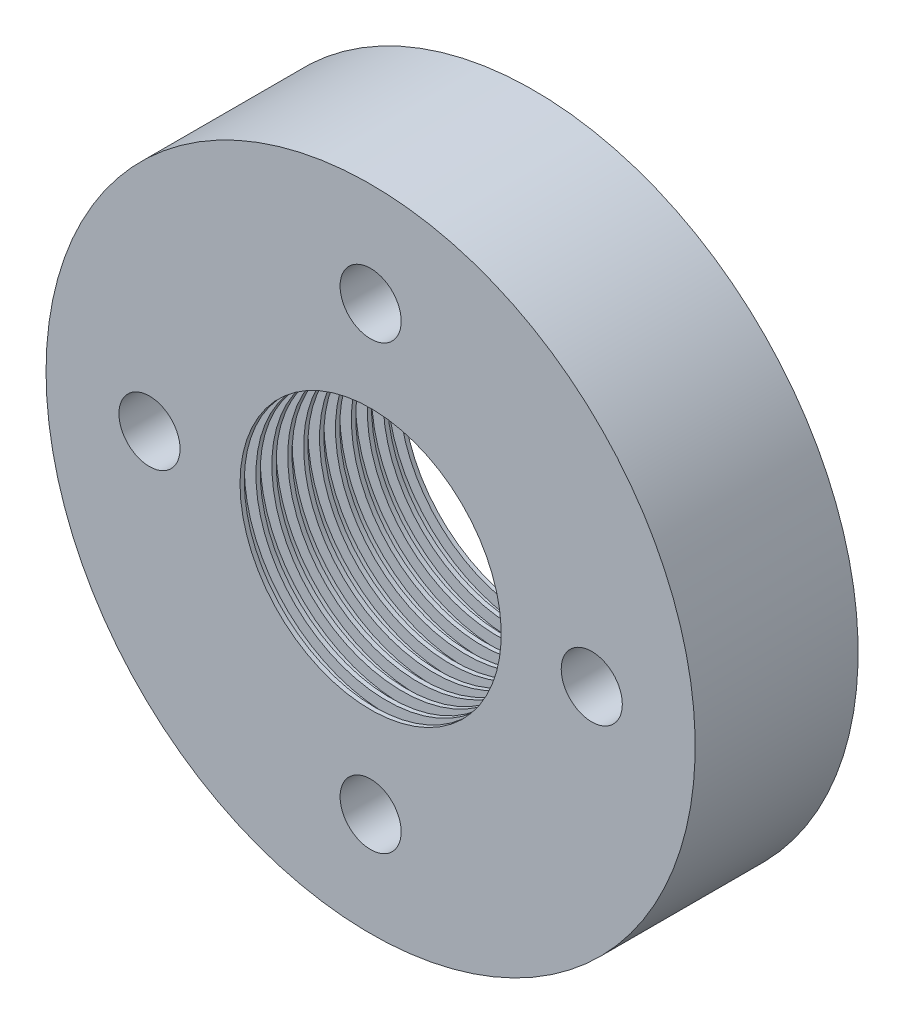
ISO-10303-21;
HEADER;
FILE_DESCRIPTION(('STEP AP214'),'2;1');
FILE_NAME('part.step','',(''),(''),'','','');
FILE_SCHEMA(('AUTOMOTIVE_DESIGN { 1 0 10303 214 1 1 1 1 }'));
ENDSEC;
DATA;
#1=APPLICATION_CONTEXT('core data for automotive mechanical design processes');
#2=APPLICATION_PROTOCOL_DEFINITION('international standard','automotive_design',2000,#1);
#3=PRODUCT_CONTEXT('',#1,'mechanical');
#4=PRODUCT('Part','Part','',(#3));
#5=PRODUCT_RELATED_PRODUCT_CATEGORY('part','',(#4));
#6=PRODUCT_DEFINITION_FORMATION('','',#4);
#7=PRODUCT_DEFINITION_CONTEXT('part definition',#1,'design');
#8=PRODUCT_DEFINITION('design','',#6,#7);
#9=PRODUCT_DEFINITION_SHAPE('','',#8);
#10=(LENGTH_UNIT() NAMED_UNIT(*) SI_UNIT(.MILLI.,.METRE.));
#11=(NAMED_UNIT(*) PLANE_ANGLE_UNIT() SI_UNIT($,.RADIAN.));
#12=(NAMED_UNIT(*) SI_UNIT($,.STERADIAN.) SOLID_ANGLE_UNIT());
#13=UNCERTAINTY_MEASURE_WITH_UNIT(LENGTH_MEASURE(1.E-05),#10,'distance_accuracy_value','');
#14=(GEOMETRIC_REPRESENTATION_CONTEXT(3) GLOBAL_UNCERTAINTY_ASSIGNED_CONTEXT((#13)) GLOBAL_UNIT_ASSIGNED_CONTEXT((#10,
#11,#12)) REPRESENTATION_CONTEXT('',''));
#15=CARTESIAN_POINT('',(0.,0.,0.));
#16=DIRECTION('',(0.,0.,1.));
#17=DIRECTION('',(1.,0.,0.));
#18=AXIS2_PLACEMENT_3D('',#15,#16,#17);
#19=CARTESIAN_POINT('',(0.,0.,0.));
#20=DIRECTION('',(0.,0.,-1.));
#21=DIRECTION('',(-1.,0.,0.));
#22=AXIS2_PLACEMENT_3D('',#19,#20,#21);
#23=CYLINDRICAL_SURFACE('',#22,8.5508);
#24=CARTESIAN_POINT('',(0.,0.,9.3472));
#25=DIRECTION('',(0.,0.,1.));
#26=DIRECTION('',(1.,0.,0.));
#27=AXIS2_PLACEMENT_3D('',#24,#25,#26);
#28=CIRCLE('',#27,8.5508);
#29=CARTESIAN_POINT('',(8.5508,0.,9.3472));
#30=VERTEX_POINT('',#29);
#31=EDGE_CURVE('E159',#30,#30,#28,.T.);
#32=ORIENTED_EDGE('',*,*,#31,.F.);
#33=EDGE_LOOP('',(#32));
#34=FACE_BOUND('',#33,.T.);
#35=CARTESIAN_POINT('',(0.,0.,9.6266));
#36=DIRECTION('',(0.,0.,1.));
#37=DIRECTION('',(1.,0.,0.));
#38=AXIS2_PLACEMENT_3D('',#35,#36,#37);
#39=CIRCLE('',#38,8.5508);
#40=CARTESIAN_POINT('',(8.5508,0.,9.6266));
#41=VERTEX_POINT('',#40);
#42=EDGE_CURVE('E168',#41,#41,#39,.T.);
#43=ORIENTED_EDGE('',*,*,#42,.T.);
#44=EDGE_LOOP('',(#43));
#45=FACE_BOUND('',#44,.T.);
#46=ADVANCED_FACE('F37',(#34,#45),#23,.F.);
#47=CARTESIAN_POINT('',(0.,0.,10.668));
#48=DIRECTION('',(0.,0.,-1.));
#49=DIRECTION('',(-1.,0.,0.));
#50=AXIS2_PLACEMENT_3D('',#47,#48,#49);
#51=CIRCLE('',#50,8.5508);
#52=CARTESIAN_POINT('',(-8.5508,0.,10.668));
#53=VERTEX_POINT('',#52);
#54=EDGE_CURVE('E10',#53,#53,#51,.T.);
#55=ORIENTED_EDGE('',*,*,#54,.F.);
#56=EDGE_LOOP('',(#55));
#57=FACE_BOUND('',#56,.T.);
#58=CARTESIAN_POINT('',(0.,0.,10.3886));
#59=DIRECTION('',(0.,0.,1.));
#60=DIRECTION('',(1.,0.,0.));
#61=AXIS2_PLACEMENT_3D('',#58,#59,#60);
#62=CIRCLE('',#61,8.5508);
#63=CARTESIAN_POINT('',(8.5508,0.,10.3886));
#64=VERTEX_POINT('',#63);
#65=EDGE_CURVE('E171',#64,#64,#62,.T.);
#66=ORIENTED_EDGE('',*,*,#65,.F.);
#67=EDGE_LOOP('',(#66));
#68=FACE_BOUND('',#67,.T.);
#69=ADVANCED_FACE('F253',(#57,#68),#23,.F.);
#70=CARTESIAN_POINT('',(0.,0.,8.3058));
#71=DIRECTION('',(0.,0.,1.));
#72=DIRECTION('',(1.,0.,0.));
#73=AXIS2_PLACEMENT_3D('',#70,#71,#72);
#74=CIRCLE('',#73,8.5508);
#75=CARTESIAN_POINT('',(8.5508,0.,8.3058));
#76=VERTEX_POINT('',#75);
#77=EDGE_CURVE('E147',#76,#76,#74,.T.);
#78=ORIENTED_EDGE('',*,*,#77,.F.);
#79=EDGE_LOOP('',(#78));
#80=FACE_BOUND('',#79,.T.);
#81=CARTESIAN_POINT('',(0.,0.,8.5852));
#82=DIRECTION('',(0.,0.,1.));
#83=DIRECTION('',(1.,0.,0.));
#84=AXIS2_PLACEMENT_3D('',#81,#82,#83);
#85=CIRCLE('',#84,8.5508);
#86=CARTESIAN_POINT('',(8.5508,0.,8.5852));
#87=VERTEX_POINT('',#86);
#88=EDGE_CURVE('E156',#87,#87,#85,.T.);
#89=ORIENTED_EDGE('',*,*,#88,.T.);
#90=EDGE_LOOP('',(#89));
#91=FACE_BOUND('',#90,.T.);
#92=ADVANCED_FACE('F258',(#80,#91),#23,.F.);
#93=CARTESIAN_POINT('',(0.,0.,7.2644));
#94=DIRECTION('',(0.,0.,1.));
#95=DIRECTION('',(1.,0.,0.));
#96=AXIS2_PLACEMENT_3D('',#93,#94,#95);
#97=CIRCLE('',#96,8.5508);
#98=CARTESIAN_POINT('',(8.5508,0.,7.2644));
#99=VERTEX_POINT('',#98);
#100=EDGE_CURVE('E135',#99,#99,#97,.T.);
#101=ORIENTED_EDGE('',*,*,#100,.F.);
#102=EDGE_LOOP('',(#101));
#103=FACE_BOUND('',#102,.T.);
#104=CARTESIAN_POINT('',(0.,0.,7.5438));
#105=DIRECTION('',(0.,0.,1.));
#106=DIRECTION('',(1.,0.,0.));
#107=AXIS2_PLACEMENT_3D('',#104,#105,#106);
#108=CIRCLE('',#107,8.5508);
#109=CARTESIAN_POINT('',(8.5508,0.,7.5438));
#110=VERTEX_POINT('',#109);
#111=EDGE_CURVE('E144',#110,#110,#108,.T.);
#112=ORIENTED_EDGE('',*,*,#111,.T.);
#113=EDGE_LOOP('',(#112));
#114=FACE_BOUND('',#113,.T.);
#115=ADVANCED_FACE('F435',(#103,#114),#23,.F.);
#116=CARTESIAN_POINT('',(0.,0.,6.223));
#117=DIRECTION('',(0.,0.,1.));
#118=DIRECTION('',(1.,0.,0.));
#119=AXIS2_PLACEMENT_3D('',#116,#117,#118);
#120=CIRCLE('',#119,8.5508);
#121=CARTESIAN_POINT('',(8.5508,0.,6.223));
#122=VERTEX_POINT('',#121);
#123=EDGE_CURVE('E123',#122,#122,#120,.T.);
#124=ORIENTED_EDGE('',*,*,#123,.F.);
#125=EDGE_LOOP('',(#124));
#126=FACE_BOUND('',#125,.T.);
#127=CARTESIAN_POINT('',(0.,0.,6.5024));
#128=DIRECTION('',(0.,0.,1.));
#129=DIRECTION('',(1.,0.,0.));
#130=AXIS2_PLACEMENT_3D('',#127,#128,#129);
#131=CIRCLE('',#130,8.5508);
#132=CARTESIAN_POINT('',(8.5508,0.,6.5024));
#133=VERTEX_POINT('',#132);
#134=EDGE_CURVE('E132',#133,#133,#131,.T.);
#135=ORIENTED_EDGE('',*,*,#134,.T.);
#136=EDGE_LOOP('',(#135));
#137=FACE_BOUND('',#136,.T.);
#138=ADVANCED_FACE('F422',(#126,#137),#23,.F.);
#139=CARTESIAN_POINT('',(0.,0.,5.1816));
#140=DIRECTION('',(0.,0.,1.));
#141=DIRECTION('',(1.,0.,0.));
#142=AXIS2_PLACEMENT_3D('',#139,#140,#141);
#143=CIRCLE('',#142,8.5508);
#144=CARTESIAN_POINT('',(8.5508,0.,5.1816));
#145=VERTEX_POINT('',#144);
#146=EDGE_CURVE('E111',#145,#145,#143,.T.);
#147=ORIENTED_EDGE('',*,*,#146,.F.);
#148=EDGE_LOOP('',(#147));
#149=FACE_BOUND('',#148,.T.);
#150=CARTESIAN_POINT('',(0.,0.,5.461));
#151=DIRECTION('',(0.,0.,1.));
#152=DIRECTION('',(1.,0.,0.));
#153=AXIS2_PLACEMENT_3D('',#150,#151,#152);
#154=CIRCLE('',#153,8.5508);
#155=CARTESIAN_POINT('',(8.5508,0.,5.461));
#156=VERTEX_POINT('',#155);
#157=EDGE_CURVE('E120',#156,#156,#154,.T.);
#158=ORIENTED_EDGE('',*,*,#157,.T.);
#159=EDGE_LOOP('',(#158));
#160=FACE_BOUND('',#159,.T.);
#161=ADVANCED_FACE('F409',(#149,#160),#23,.F.);
#162=CARTESIAN_POINT('',(0.,0.,4.1402));
#163=DIRECTION('',(0.,0.,1.));
#164=DIRECTION('',(1.,0.,0.));
#165=AXIS2_PLACEMENT_3D('',#162,#163,#164);
#166=CIRCLE('',#165,8.5508);
#167=CARTESIAN_POINT('',(8.5508,0.,4.1402));
#168=VERTEX_POINT('',#167);
#169=EDGE_CURVE('E99',#168,#168,#166,.T.);
#170=ORIENTED_EDGE('',*,*,#169,.F.);
#171=EDGE_LOOP('',(#170));
#172=FACE_BOUND('',#171,.T.);
#173=CARTESIAN_POINT('',(0.,0.,4.4196));
#174=DIRECTION('',(0.,0.,1.));
#175=DIRECTION('',(1.,0.,0.));
#176=AXIS2_PLACEMENT_3D('',#173,#174,#175);
#177=CIRCLE('',#176,8.5508);
#178=CARTESIAN_POINT('',(8.5508,0.,4.4196));
#179=VERTEX_POINT('',#178);
#180=EDGE_CURVE('E108',#179,#179,#177,.T.);
#181=ORIENTED_EDGE('',*,*,#180,.T.);
#182=EDGE_LOOP('',(#181));
#183=FACE_BOUND('',#182,.T.);
#184=ADVANCED_FACE('F399',(#172,#183),#23,.F.);
#185=CARTESIAN_POINT('',(0.,0.,3.0988));
#186=DIRECTION('',(0.,0.,1.));
#187=DIRECTION('',(1.,0.,0.));
#188=AXIS2_PLACEMENT_3D('',#185,#186,#187);
#189=CIRCLE('',#188,8.5508);
#190=CARTESIAN_POINT('',(8.5508,0.,3.0988));
#191=VERTEX_POINT('',#190);
#192=EDGE_CURVE('E87',#191,#191,#189,.T.);
#193=ORIENTED_EDGE('',*,*,#192,.F.);
#194=EDGE_LOOP('',(#193));
#195=FACE_BOUND('',#194,.T.);
#196=CARTESIAN_POINT('',(0.,0.,3.3782));
#197=DIRECTION('',(0.,0.,1.));
#198=DIRECTION('',(1.,0.,0.));
#199=AXIS2_PLACEMENT_3D('',#196,#197,#198);
#200=CIRCLE('',#199,8.5508);
#201=CARTESIAN_POINT('',(8.5508,0.,3.3782));
#202=VERTEX_POINT('',#201);
#203=EDGE_CURVE('E96',#202,#202,#200,.T.);
#204=ORIENTED_EDGE('',*,*,#203,.T.);
#205=EDGE_LOOP('',(#204));
#206=FACE_BOUND('',#205,.T.);
#207=ADVANCED_FACE('F389',(#195,#206),#23,.F.);
#208=CARTESIAN_POINT('',(0.,0.,2.0574));
#209=DIRECTION('',(0.,0.,1.));
#210=DIRECTION('',(1.,0.,0.));
#211=AXIS2_PLACEMENT_3D('',#208,#209,#210);
#212=CIRCLE('',#211,8.5508);
#213=CARTESIAN_POINT('',(8.5508,0.,2.0574));
#214=VERTEX_POINT('',#213);
#215=EDGE_CURVE('E75',#214,#214,#212,.T.);
#216=ORIENTED_EDGE('',*,*,#215,.F.);
#217=EDGE_LOOP('',(#216));
#218=FACE_BOUND('',#217,.T.);
#219=CARTESIAN_POINT('',(0.,0.,2.3368));
#220=DIRECTION('',(0.,0.,1.));
#221=DIRECTION('',(1.,0.,0.));
#222=AXIS2_PLACEMENT_3D('',#219,#220,#221);
#223=CIRCLE('',#222,8.5508);
#224=CARTESIAN_POINT('',(8.5508,0.,2.3368));
#225=VERTEX_POINT('',#224);
#226=EDGE_CURVE('E84',#225,#225,#223,.T.);
#227=ORIENTED_EDGE('',*,*,#226,.T.);
#228=EDGE_LOOP('',(#227));
#229=FACE_BOUND('',#228,.T.);
#230=ADVANCED_FACE('F384',(#218,#229),#23,.F.);
#231=CARTESIAN_POINT('',(0.,0.,1.016));
#232=DIRECTION('',(0.,0.,1.));
#233=DIRECTION('',(1.,0.,0.));
#234=AXIS2_PLACEMENT_3D('',#231,#232,#233);
#235=CIRCLE('',#234,8.5508);
#236=CARTESIAN_POINT('',(8.5508,0.,1.016));
#237=VERTEX_POINT('',#236);
#238=EDGE_CURVE('E63',#237,#237,#235,.T.);
#239=ORIENTED_EDGE('',*,*,#238,.F.);
#240=EDGE_LOOP('',(#239));
#241=FACE_BOUND('',#240,.T.);
#242=CARTESIAN_POINT('',(0.,0.,1.2954));
#243=DIRECTION('',(0.,0.,1.));
#244=DIRECTION('',(1.,0.,0.));
#245=AXIS2_PLACEMENT_3D('',#242,#243,#244);
#246=CIRCLE('',#245,8.5508);
#247=CARTESIAN_POINT('',(8.5508,0.,1.2954));
#248=VERTEX_POINT('',#247);
#249=EDGE_CURVE('E72',#248,#248,#246,.T.);
#250=ORIENTED_EDGE('',*,*,#249,.T.);
#251=EDGE_LOOP('',(#250));
#252=FACE_BOUND('',#251,.T.);
#253=ADVANCED_FACE('F235',(#241,#252),#23,.F.);
#254=CARTESIAN_POINT('',(0.,0.,0.));
#255=DIRECTION('',(0.,0.,-1.));
#256=DIRECTION('',(-1.,0.,0.));
#257=AXIS2_PLACEMENT_3D('',#254,#255,#256);
#258=CIRCLE('',#257,8.5508);
#259=CARTESIAN_POINT('',(-8.5508,0.,0.));
#260=VERTEX_POINT('',#259);
#261=EDGE_CURVE('E52',#260,#260,#258,.T.);
#262=ORIENTED_EDGE('',*,*,#261,.T.);
#263=EDGE_LOOP('',(#262));
#264=FACE_BOUND('',#263,.T.);
#265=CARTESIAN_POINT('',(0.,0.,0.254000000000001));
#266=DIRECTION('',(0.,0.,1.));
#267=DIRECTION('',(1.,0.,0.));
#268=AXIS2_PLACEMENT_3D('',#265,#266,#267);
#269=CIRCLE('',#268,8.5508);
#270=CARTESIAN_POINT('',(8.5508,0.,0.254000000000001));
#271=VERTEX_POINT('',#270);
#272=EDGE_CURVE('E60',#271,#271,#269,.T.);
#273=ORIENTED_EDGE('',*,*,#272,.T.);
#274=EDGE_LOOP('',(#273));
#275=FACE_BOUND('',#274,.T.);
#276=ADVANCED_FACE('F39',(#264,#275),#23,.F.);
#277=CARTESIAN_POINT('',(0.,8.5508,10.668));
#278=DIRECTION('',(0.,0.,1.));
#279=DIRECTION('',(1.,0.,0.));
#280=AXIS2_PLACEMENT_3D('',#277,#278,#279);
#281=PLANE('',#280);
#282=CARTESIAN_POINT('',(-14.478,1.51649000471313E-13,10.668));
#283=DIRECTION('',(0.,0.,1.));
#284=DIRECTION('',(1.,0.,0.));
#285=AXIS2_PLACEMENT_3D('',#282,#283,#284);
#286=CIRCLE('',#285,2.);
#287=CARTESIAN_POINT('',(-12.478,1.51649000471313E-13,10.668));
#288=VERTEX_POINT('',#287);
#289=EDGE_CURVE('E204',#288,#288,#286,.T.);
#290=ORIENTED_EDGE('',*,*,#289,.F.);
#291=EDGE_LOOP('',(#290));
#292=FACE_BOUND('',#291,.T.);
#293=CARTESIAN_POINT('',(0.,-14.478,10.668));
#294=DIRECTION('',(0.,0.,1.));
#295=DIRECTION('',(1.,0.,0.));
#296=AXIS2_PLACEMENT_3D('',#293,#294,#295);
#297=CIRCLE('',#296,2.);
#298=CARTESIAN_POINT('',(2.,-14.478,10.668));
#299=VERTEX_POINT('',#298);
#300=EDGE_CURVE('E195',#299,#299,#297,.T.);
#301=ORIENTED_EDGE('',*,*,#300,.F.);
#302=EDGE_LOOP('',(#301));
#303=FACE_BOUND('',#302,.T.);
#304=CARTESIAN_POINT('',(14.478,0.,10.668));
#305=DIRECTION('',(0.,0.,1.));
#306=DIRECTION('',(1.,0.,0.));
#307=AXIS2_PLACEMENT_3D('',#304,#305,#306);
#308=CIRCLE('',#307,2.);
#309=CARTESIAN_POINT('',(16.478,0.,10.668));
#310=VERTEX_POINT('',#309);
#311=EDGE_CURVE('E186',#310,#310,#308,.T.);
#312=ORIENTED_EDGE('',*,*,#311,.F.);
#313=EDGE_LOOP('',(#312));
#314=FACE_BOUND('',#313,.T.);
#315=CARTESIAN_POINT('',(0.,14.478,10.668));
#316=DIRECTION('',(0.,0.,1.));
#317=DIRECTION('',(1.,0.,0.));
#318=AXIS2_PLACEMENT_3D('',#315,#316,#317);
#319=CIRCLE('',#318,2.);
#320=CARTESIAN_POINT('',(2.,14.478,10.668));
#321=VERTEX_POINT('',#320);
#322=EDGE_CURVE('E177',#321,#321,#319,.T.);
#323=ORIENTED_EDGE('',*,*,#322,.F.);
#324=EDGE_LOOP('',(#323));
#325=FACE_BOUND('',#324,.T.);
#326=ORIENTED_EDGE('',*,*,#54,.T.);
#327=EDGE_LOOP('',(#326));
#328=FACE_BOUND('',#327,.T.);
#329=CARTESIAN_POINT('',(0.,0.,10.668));
#330=DIRECTION('',(0.,0.,-1.));
#331=DIRECTION('',(-1.,0.,0.));
#332=AXIS2_PLACEMENT_3D('',#329,#330,#331);
#333=CIRCLE('',#332,21.2508);
#334=CARTESIAN_POINT('',(-21.2508,0.,10.668));
#335=VERTEX_POINT('',#334);
#336=EDGE_CURVE('E44',#335,#335,#333,.T.);
#337=ORIENTED_EDGE('',*,*,#336,.F.);
#338=EDGE_LOOP('',(#337));
#339=FACE_BOUND('',#338,.T.);
#340=ADVANCED_FACE('F234',(#292,#303,#314,#325,#328,#339),#281,.T.);
#341=CARTESIAN_POINT('',(0.,0.,0.));
#342=DIRECTION('',(0.,0.,-1.));
#343=DIRECTION('',(-1.,0.,0.));
#344=AXIS2_PLACEMENT_3D('',#341,#342,#343);
#345=CYLINDRICAL_SURFACE('',#344,21.2508);
#346=ORIENTED_EDGE('',*,*,#336,.T.);
#347=EDGE_LOOP('',(#346));
#348=FACE_BOUND('',#347,.T.);
#349=CARTESIAN_POINT('',(0.,0.,0.));
#350=DIRECTION('',(0.,0.,-1.));
#351=DIRECTION('',(-1.,0.,0.));
#352=AXIS2_PLACEMENT_3D('',#349,#350,#351);
#353=CIRCLE('',#352,21.2508);
#354=CARTESIAN_POINT('',(-21.2508,0.,0.));
#355=VERTEX_POINT('',#354);
#356=EDGE_CURVE('E48',#355,#355,#353,.T.);
#357=ORIENTED_EDGE('',*,*,#356,.F.);
#358=EDGE_LOOP('',(#357));
#359=FACE_BOUND('',#358,.T.);
#360=ADVANCED_FACE('F220',(#348,#359),#345,.T.);
#361=CARTESIAN_POINT('',(0.,21.2508,0.));
#362=DIRECTION('',(0.,0.,-1.));
#363=DIRECTION('',(-1.,0.,0.));
#364=AXIS2_PLACEMENT_3D('',#361,#362,#363);
#365=PLANE('',#364);
#366=CARTESIAN_POINT('',(-14.478,1.51649000471313E-13,0.));
#367=DIRECTION('',(0.,0.,-1.));
#368=DIRECTION('',(-1.,0.,0.));
#369=AXIS2_PLACEMENT_3D('',#366,#367,#368);
#370=CIRCLE('',#369,2.025);
#371=CARTESIAN_POINT('',(-16.503,1.51649000471313E-13,0.));
#372=VERTEX_POINT('',#371);
#373=EDGE_CURVE('E210',#372,#372,#370,.T.);
#374=ORIENTED_EDGE('',*,*,#373,.F.);
#375=EDGE_LOOP('',(#374));
#376=FACE_BOUND('',#375,.T.);
#377=CARTESIAN_POINT('',(0.,-14.478,0.));
#378=DIRECTION('',(0.,0.,-1.));
#379=DIRECTION('',(-1.,0.,0.));
#380=AXIS2_PLACEMENT_3D('',#377,#378,#379);
#381=CIRCLE('',#380,2.025);
#382=CARTESIAN_POINT('',(-2.025,-14.478,0.));
#383=VERTEX_POINT('',#382);
#384=EDGE_CURVE('E201',#383,#383,#381,.T.);
#385=ORIENTED_EDGE('',*,*,#384,.F.);
#386=EDGE_LOOP('',(#385));
#387=FACE_BOUND('',#386,.T.);
#388=CARTESIAN_POINT('',(14.478,0.,0.));
#389=DIRECTION('',(0.,0.,-1.));
#390=DIRECTION('',(-1.,0.,0.));
#391=AXIS2_PLACEMENT_3D('',#388,#389,#390);
#392=CIRCLE('',#391,2.025);
#393=CARTESIAN_POINT('',(12.453,0.,0.));
#394=VERTEX_POINT('',#393);
#395=EDGE_CURVE('E192',#394,#394,#392,.T.);
#396=ORIENTED_EDGE('',*,*,#395,.F.);
#397=EDGE_LOOP('',(#396));
#398=FACE_BOUND('',#397,.T.);
#399=CARTESIAN_POINT('',(0.,14.478,0.));
#400=DIRECTION('',(0.,0.,-1.));
#401=DIRECTION('',(-1.,0.,0.));
#402=AXIS2_PLACEMENT_3D('',#399,#400,#401);
#403=CIRCLE('',#402,2.025);
#404=CARTESIAN_POINT('',(-2.025,14.478,0.));
#405=VERTEX_POINT('',#404);
#406=EDGE_CURVE('E183',#405,#405,#403,.T.);
#407=ORIENTED_EDGE('',*,*,#406,.F.);
#408=EDGE_LOOP('',(#407));
#409=FACE_BOUND('',#408,.T.);
#410=ORIENTED_EDGE('',*,*,#356,.T.);
#411=EDGE_LOOP('',(#410));
#412=FACE_BOUND('',#411,.T.);
#413=ORIENTED_EDGE('',*,*,#261,.F.);
#414=EDGE_LOOP('',(#413));
#415=FACE_BOUND('',#414,.T.);
#416=ADVANCED_FACE('F216',(#376,#387,#398,#409,#412,#415),#365,.T.);
#417=CARTESIAN_POINT('',(0.,0.,10.668));
#418=DIRECTION('',(0.,0.,1.));
#419=DIRECTION('',(1.,0.,0.));
#420=AXIS2_PLACEMENT_3D('',#417,#418,#419);
#421=CYLINDRICAL_SURFACE('',#420,9.3128);
#422=CARTESIAN_POINT('',(0.,0.,1.016));
#423=DIRECTION('',(0.,0.,1.));
#424=DIRECTION('',(1.,0.,0.));
#425=AXIS2_PLACEMENT_3D('',#422,#423,#424);
#426=CIRCLE('',#425,9.3128);
#427=CARTESIAN_POINT('',(9.3128,0.,1.016));
#428=VERTEX_POINT('',#427);
#429=EDGE_CURVE('E66',#428,#428,#426,.T.);
#430=ORIENTED_EDGE('',*,*,#429,.T.);
#431=EDGE_LOOP('',(#430));
#432=FACE_BOUND('',#431,.T.);
#433=CARTESIAN_POINT('',(0.,0.,0.254000000000001));
#434=DIRECTION('',(0.,0.,1.));
#435=DIRECTION('',(1.,0.,0.));
#436=AXIS2_PLACEMENT_3D('',#433,#434,#435);
#437=CIRCLE('',#436,9.3128);
#438=CARTESIAN_POINT('',(9.3128,0.,0.254000000000001));
#439=VERTEX_POINT('',#438);
#440=EDGE_CURVE('E57',#439,#439,#437,.T.);
#441=ORIENTED_EDGE('',*,*,#440,.F.);
#442=EDGE_LOOP('',(#441));
#443=FACE_BOUND('',#442,.T.);
#444=ADVANCED_FACE('F219',(#432,#443),#421,.F.);
#445=CARTESIAN_POINT('',(0.,9.3128,0.254));
#446=DIRECTION('',(0.,0.,1.));
#447=DIRECTION('',(1.,0.,0.));
#448=AXIS2_PLACEMENT_3D('',#445,#446,#447);
#449=PLANE('',#448);
#450=ORIENTED_EDGE('',*,*,#440,.T.);
#451=EDGE_LOOP('',(#450));
#452=FACE_BOUND('',#451,.T.);
#453=ORIENTED_EDGE('',*,*,#272,.F.);
#454=EDGE_LOOP('',(#453));
#455=FACE_BOUND('',#454,.T.);
#456=ADVANCED_FACE('F238',(#452,#455),#449,.T.);
#457=CARTESIAN_POINT('',(0.,8.5508,1.016));
#458=DIRECTION('',(0.,0.,-1.));
#459=DIRECTION('',(-1.,0.,0.));
#460=AXIS2_PLACEMENT_3D('',#457,#458,#459);
#461=PLANE('',#460);
#462=ORIENTED_EDGE('',*,*,#238,.T.);
#463=EDGE_LOOP('',(#462));
#464=FACE_BOUND('',#463,.T.);
#465=ORIENTED_EDGE('',*,*,#429,.F.);
#466=EDGE_LOOP('',(#465));
#467=FACE_BOUND('',#466,.T.);
#468=ADVANCED_FACE('F240',(#464,#467),#461,.T.);
#469=CARTESIAN_POINT('',(0.,0.,11.7094));
#470=DIRECTION('',(0.,0.,1.));
#471=DIRECTION('',(1.,0.,0.));
#472=AXIS2_PLACEMENT_3D('',#469,#470,#471);
#473=CYLINDRICAL_SURFACE('',#472,9.3128);
#474=CARTESIAN_POINT('',(0.,0.,2.0574));
#475=DIRECTION('',(0.,0.,1.));
#476=DIRECTION('',(1.,0.,0.));
#477=AXIS2_PLACEMENT_3D('',#474,#475,#476);
#478=CIRCLE('',#477,9.3128);
#479=CARTESIAN_POINT('',(9.3128,0.,2.0574));
#480=VERTEX_POINT('',#479);
#481=EDGE_CURVE('E78',#480,#480,#478,.T.);
#482=ORIENTED_EDGE('',*,*,#481,.T.);
#483=EDGE_LOOP('',(#482));
#484=FACE_BOUND('',#483,.T.);
#485=CARTESIAN_POINT('',(0.,0.,1.2954));
#486=DIRECTION('',(0.,0.,1.));
#487=DIRECTION('',(1.,0.,0.));
#488=AXIS2_PLACEMENT_3D('',#485,#486,#487);
#489=CIRCLE('',#488,9.3128);
#490=CARTESIAN_POINT('',(9.3128,0.,1.2954));
#491=VERTEX_POINT('',#490);
#492=EDGE_CURVE('E69',#491,#491,#489,.T.);
#493=ORIENTED_EDGE('',*,*,#492,.F.);
#494=EDGE_LOOP('',(#493));
#495=FACE_BOUND('',#494,.T.);
#496=ADVANCED_FACE('F247',(#484,#495),#473,.F.);
#497=CARTESIAN_POINT('',(0.,9.3128,1.2954));
#498=DIRECTION('',(0.,0.,1.));
#499=DIRECTION('',(1.,0.,0.));
#500=AXIS2_PLACEMENT_3D('',#497,#498,#499);
#501=PLANE('',#500);
#502=ORIENTED_EDGE('',*,*,#492,.T.);
#503=EDGE_LOOP('',(#502));
#504=FACE_BOUND('',#503,.T.);
#505=ORIENTED_EDGE('',*,*,#249,.F.);
#506=EDGE_LOOP('',(#505));
#507=FACE_BOUND('',#506,.T.);
#508=ADVANCED_FACE('F368',(#504,#507),#501,.T.);
#509=CARTESIAN_POINT('',(0.,8.5508,2.0574));
#510=DIRECTION('',(0.,0.,-1.));
#511=DIRECTION('',(-1.,0.,0.));
#512=AXIS2_PLACEMENT_3D('',#509,#510,#511);
#513=PLANE('',#512);
#514=ORIENTED_EDGE('',*,*,#215,.T.);
#515=EDGE_LOOP('',(#514));
#516=FACE_BOUND('',#515,.T.);
#517=ORIENTED_EDGE('',*,*,#481,.F.);
#518=EDGE_LOOP('',(#517));
#519=FACE_BOUND('',#518,.T.);
#520=ADVANCED_FACE('F364',(#516,#519),#513,.T.);
#521=CARTESIAN_POINT('',(0.,0.,12.7508));
#522=DIRECTION('',(0.,0.,1.));
#523=DIRECTION('',(1.,0.,0.));
#524=AXIS2_PLACEMENT_3D('',#521,#522,#523);
#525=CYLINDRICAL_SURFACE('',#524,9.3128);
#526=CARTESIAN_POINT('',(0.,0.,3.0988));
#527=DIRECTION('',(0.,0.,1.));
#528=DIRECTION('',(1.,0.,0.));
#529=AXIS2_PLACEMENT_3D('',#526,#527,#528);
#530=CIRCLE('',#529,9.3128);
#531=CARTESIAN_POINT('',(9.3128,0.,3.0988));
#532=VERTEX_POINT('',#531);
#533=EDGE_CURVE('E90',#532,#532,#530,.T.);
#534=ORIENTED_EDGE('',*,*,#533,.T.);
#535=EDGE_LOOP('',(#534));
#536=FACE_BOUND('',#535,.T.);
#537=CARTESIAN_POINT('',(0.,0.,2.3368));
#538=DIRECTION('',(0.,0.,1.));
#539=DIRECTION('',(1.,0.,0.));
#540=AXIS2_PLACEMENT_3D('',#537,#538,#539);
#541=CIRCLE('',#540,9.3128);
#542=CARTESIAN_POINT('',(9.3128,0.,2.3368));
#543=VERTEX_POINT('',#542);
#544=EDGE_CURVE('E81',#543,#543,#541,.T.);
#545=ORIENTED_EDGE('',*,*,#544,.F.);
#546=EDGE_LOOP('',(#545));
#547=FACE_BOUND('',#546,.T.);
#548=ADVANCED_FACE('F360',(#536,#547),#525,.F.);
#549=CARTESIAN_POINT('',(0.,9.3128,2.3368));
#550=DIRECTION('',(0.,0.,1.));
#551=DIRECTION('',(1.,0.,0.));
#552=AXIS2_PLACEMENT_3D('',#549,#550,#551);
#553=PLANE('',#552);
#554=ORIENTED_EDGE('',*,*,#544,.T.);
#555=EDGE_LOOP('',(#554));
#556=FACE_BOUND('',#555,.T.);
#557=ORIENTED_EDGE('',*,*,#226,.F.);
#558=EDGE_LOOP('',(#557));
#559=FACE_BOUND('',#558,.T.);
#560=ADVANCED_FACE('F356',(#556,#559),#553,.T.);
#561=CARTESIAN_POINT('',(0.,8.5508,3.0988));
#562=DIRECTION('',(0.,0.,-1.));
#563=DIRECTION('',(-1.,0.,0.));
#564=AXIS2_PLACEMENT_3D('',#561,#562,#563);
#565=PLANE('',#564);
#566=ORIENTED_EDGE('',*,*,#192,.T.);
#567=EDGE_LOOP('',(#566));
#568=FACE_BOUND('',#567,.T.);
#569=ORIENTED_EDGE('',*,*,#533,.F.);
#570=EDGE_LOOP('',(#569));
#571=FACE_BOUND('',#570,.T.);
#572=ADVANCED_FACE('F352',(#568,#571),#565,.T.);
#573=CARTESIAN_POINT('',(0.,0.,13.7922));
#574=DIRECTION('',(0.,0.,1.));
#575=DIRECTION('',(1.,0.,0.));
#576=AXIS2_PLACEMENT_3D('',#573,#574,#575);
#577=CYLINDRICAL_SURFACE('',#576,9.3128);
#578=CARTESIAN_POINT('',(0.,0.,4.1402));
#579=DIRECTION('',(0.,0.,1.));
#580=DIRECTION('',(1.,0.,0.));
#581=AXIS2_PLACEMENT_3D('',#578,#579,#580);
#582=CIRCLE('',#581,9.3128);
#583=CARTESIAN_POINT('',(9.3128,0.,4.1402));
#584=VERTEX_POINT('',#583);
#585=EDGE_CURVE('E102',#584,#584,#582,.T.);
#586=ORIENTED_EDGE('',*,*,#585,.T.);
#587=EDGE_LOOP('',(#586));
#588=FACE_BOUND('',#587,.T.);
#589=CARTESIAN_POINT('',(0.,0.,3.3782));
#590=DIRECTION('',(0.,0.,1.));
#591=DIRECTION('',(1.,0.,0.));
#592=AXIS2_PLACEMENT_3D('',#589,#590,#591);
#593=CIRCLE('',#592,9.3128);
#594=CARTESIAN_POINT('',(9.3128,0.,3.3782));
#595=VERTEX_POINT('',#594);
#596=EDGE_CURVE('E93',#595,#595,#593,.T.);
#597=ORIENTED_EDGE('',*,*,#596,.F.);
#598=EDGE_LOOP('',(#597));
#599=FACE_BOUND('',#598,.T.);
#600=ADVANCED_FACE('F348',(#588,#599),#577,.F.);
#601=CARTESIAN_POINT('',(0.,9.3128,3.3782));
#602=DIRECTION('',(0.,0.,1.));
#603=DIRECTION('',(1.,0.,0.));
#604=AXIS2_PLACEMENT_3D('',#601,#602,#603);
#605=PLANE('',#604);
#606=ORIENTED_EDGE('',*,*,#596,.T.);
#607=EDGE_LOOP('',(#606));
#608=FACE_BOUND('',#607,.T.);
#609=ORIENTED_EDGE('',*,*,#203,.F.);
#610=EDGE_LOOP('',(#609));
#611=FACE_BOUND('',#610,.T.);
#612=ADVANCED_FACE('F344',(#608,#611),#605,.T.);
#613=CARTESIAN_POINT('',(0.,8.5508,4.1402));
#614=DIRECTION('',(0.,0.,-1.));
#615=DIRECTION('',(-1.,0.,0.));
#616=AXIS2_PLACEMENT_3D('',#613,#614,#615);
#617=PLANE('',#616);
#618=ORIENTED_EDGE('',*,*,#169,.T.);
#619=EDGE_LOOP('',(#618));
#620=FACE_BOUND('',#619,.T.);
#621=ORIENTED_EDGE('',*,*,#585,.F.);
#622=EDGE_LOOP('',(#621));
#623=FACE_BOUND('',#622,.T.);
#624=ADVANCED_FACE('F340',(#620,#623),#617,.T.);
#625=CARTESIAN_POINT('',(0.,0.,14.8336));
#626=DIRECTION('',(0.,0.,1.));
#627=DIRECTION('',(1.,0.,0.));
#628=AXIS2_PLACEMENT_3D('',#625,#626,#627);
#629=CYLINDRICAL_SURFACE('',#628,9.3128);
#630=CARTESIAN_POINT('',(0.,0.,5.1816));
#631=DIRECTION('',(0.,0.,1.));
#632=DIRECTION('',(1.,0.,0.));
#633=AXIS2_PLACEMENT_3D('',#630,#631,#632);
#634=CIRCLE('',#633,9.3128);
#635=CARTESIAN_POINT('',(9.3128,0.,5.1816));
#636=VERTEX_POINT('',#635);
#637=EDGE_CURVE('E114',#636,#636,#634,.T.);
#638=ORIENTED_EDGE('',*,*,#637,.T.);
#639=EDGE_LOOP('',(#638));
#640=FACE_BOUND('',#639,.T.);
#641=CARTESIAN_POINT('',(0.,0.,4.4196));
#642=DIRECTION('',(0.,0.,1.));
#643=DIRECTION('',(1.,0.,0.));
#644=AXIS2_PLACEMENT_3D('',#641,#642,#643);
#645=CIRCLE('',#644,9.3128);
#646=CARTESIAN_POINT('',(9.3128,0.,4.4196));
#647=VERTEX_POINT('',#646);
#648=EDGE_CURVE('E105',#647,#647,#645,.T.);
#649=ORIENTED_EDGE('',*,*,#648,.F.);
#650=EDGE_LOOP('',(#649));
#651=FACE_BOUND('',#650,.T.);
#652=ADVANCED_FACE('F336',(#640,#651),#629,.F.);
#653=CARTESIAN_POINT('',(0.,9.3128,4.4196));
#654=DIRECTION('',(0.,0.,1.));
#655=DIRECTION('',(1.,0.,0.));
#656=AXIS2_PLACEMENT_3D('',#653,#654,#655);
#657=PLANE('',#656);
#658=ORIENTED_EDGE('',*,*,#648,.T.);
#659=EDGE_LOOP('',(#658));
#660=FACE_BOUND('',#659,.T.);
#661=ORIENTED_EDGE('',*,*,#180,.F.);
#662=EDGE_LOOP('',(#661));
#663=FACE_BOUND('',#662,.T.);
#664=ADVANCED_FACE('F332',(#660,#663),#657,.T.);
#665=CARTESIAN_POINT('',(0.,8.5508,5.1816));
#666=DIRECTION('',(0.,0.,-1.));
#667=DIRECTION('',(-1.,0.,0.));
#668=AXIS2_PLACEMENT_3D('',#665,#666,#667);
#669=PLANE('',#668);
#670=ORIENTED_EDGE('',*,*,#146,.T.);
#671=EDGE_LOOP('',(#670));
#672=FACE_BOUND('',#671,.T.);
#673=ORIENTED_EDGE('',*,*,#637,.F.);
#674=EDGE_LOOP('',(#673));
#675=FACE_BOUND('',#674,.T.);
#676=ADVANCED_FACE('F328',(#672,#675),#669,.T.);
#677=CARTESIAN_POINT('',(0.,0.,15.875));
#678=DIRECTION('',(0.,0.,1.));
#679=DIRECTION('',(1.,0.,0.));
#680=AXIS2_PLACEMENT_3D('',#677,#678,#679);
#681=CYLINDRICAL_SURFACE('',#680,9.3128);
#682=CARTESIAN_POINT('',(0.,0.,6.223));
#683=DIRECTION('',(0.,0.,1.));
#684=DIRECTION('',(1.,0.,0.));
#685=AXIS2_PLACEMENT_3D('',#682,#683,#684);
#686=CIRCLE('',#685,9.3128);
#687=CARTESIAN_POINT('',(9.3128,0.,6.223));
#688=VERTEX_POINT('',#687);
#689=EDGE_CURVE('E126',#688,#688,#686,.T.);
#690=ORIENTED_EDGE('',*,*,#689,.T.);
#691=EDGE_LOOP('',(#690));
#692=FACE_BOUND('',#691,.T.);
#693=CARTESIAN_POINT('',(0.,0.,5.461));
#694=DIRECTION('',(0.,0.,1.));
#695=DIRECTION('',(1.,0.,0.));
#696=AXIS2_PLACEMENT_3D('',#693,#694,#695);
#697=CIRCLE('',#696,9.3128);
#698=CARTESIAN_POINT('',(9.3128,0.,5.461));
#699=VERTEX_POINT('',#698);
#700=EDGE_CURVE('E117',#699,#699,#697,.T.);
#701=ORIENTED_EDGE('',*,*,#700,.F.);
#702=EDGE_LOOP('',(#701));
#703=FACE_BOUND('',#702,.T.);
#704=ADVANCED_FACE('F324',(#692,#703),#681,.F.);
#705=CARTESIAN_POINT('',(0.,9.3128,5.461));
#706=DIRECTION('',(0.,0.,1.));
#707=DIRECTION('',(1.,0.,0.));
#708=AXIS2_PLACEMENT_3D('',#705,#706,#707);
#709=PLANE('',#708);
#710=ORIENTED_EDGE('',*,*,#700,.T.);
#711=EDGE_LOOP('',(#710));
#712=FACE_BOUND('',#711,.T.);
#713=ORIENTED_EDGE('',*,*,#157,.F.);
#714=EDGE_LOOP('',(#713));
#715=FACE_BOUND('',#714,.T.);
#716=ADVANCED_FACE('F320',(#712,#715),#709,.T.);
#717=CARTESIAN_POINT('',(0.,8.5508,6.223));
#718=DIRECTION('',(0.,0.,-1.));
#719=DIRECTION('',(-1.,0.,0.));
#720=AXIS2_PLACEMENT_3D('',#717,#718,#719);
#721=PLANE('',#720);
#722=ORIENTED_EDGE('',*,*,#123,.T.);
#723=EDGE_LOOP('',(#722));
#724=FACE_BOUND('',#723,.T.);
#725=ORIENTED_EDGE('',*,*,#689,.F.);
#726=EDGE_LOOP('',(#725));
#727=FACE_BOUND('',#726,.T.);
#728=ADVANCED_FACE('F316',(#724,#727),#721,.T.);
#729=CARTESIAN_POINT('',(0.,0.,16.9164));
#730=DIRECTION('',(0.,0.,1.));
#731=DIRECTION('',(1.,0.,0.));
#732=AXIS2_PLACEMENT_3D('',#729,#730,#731);
#733=CYLINDRICAL_SURFACE('',#732,9.3128);
#734=CARTESIAN_POINT('',(0.,0.,7.2644));
#735=DIRECTION('',(0.,0.,1.));
#736=DIRECTION('',(1.,0.,0.));
#737=AXIS2_PLACEMENT_3D('',#734,#735,#736);
#738=CIRCLE('',#737,9.3128);
#739=CARTESIAN_POINT('',(9.3128,0.,7.2644));
#740=VERTEX_POINT('',#739);
#741=EDGE_CURVE('E138',#740,#740,#738,.T.);
#742=ORIENTED_EDGE('',*,*,#741,.T.);
#743=EDGE_LOOP('',(#742));
#744=FACE_BOUND('',#743,.T.);
#745=CARTESIAN_POINT('',(0.,0.,6.5024));
#746=DIRECTION('',(0.,0.,1.));
#747=DIRECTION('',(1.,0.,0.));
#748=AXIS2_PLACEMENT_3D('',#745,#746,#747);
#749=CIRCLE('',#748,9.3128);
#750=CARTESIAN_POINT('',(9.3128,0.,6.5024));
#751=VERTEX_POINT('',#750);
#752=EDGE_CURVE('E129',#751,#751,#749,.T.);
#753=ORIENTED_EDGE('',*,*,#752,.F.);
#754=EDGE_LOOP('',(#753));
#755=FACE_BOUND('',#754,.T.);
#756=ADVANCED_FACE('F312',(#744,#755),#733,.F.);
#757=CARTESIAN_POINT('',(0.,9.3128,6.5024));
#758=DIRECTION('',(0.,0.,1.));
#759=DIRECTION('',(1.,0.,0.));
#760=AXIS2_PLACEMENT_3D('',#757,#758,#759);
#761=PLANE('',#760);
#762=ORIENTED_EDGE('',*,*,#752,.T.);
#763=EDGE_LOOP('',(#762));
#764=FACE_BOUND('',#763,.T.);
#765=ORIENTED_EDGE('',*,*,#134,.F.);
#766=EDGE_LOOP('',(#765));
#767=FACE_BOUND('',#766,.T.);
#768=ADVANCED_FACE('F308',(#764,#767),#761,.T.);
#769=CARTESIAN_POINT('',(0.,8.5508,7.2644));
#770=DIRECTION('',(0.,0.,-1.));
#771=DIRECTION('',(-1.,0.,0.));
#772=AXIS2_PLACEMENT_3D('',#769,#770,#771);
#773=PLANE('',#772);
#774=ORIENTED_EDGE('',*,*,#100,.T.);
#775=EDGE_LOOP('',(#774));
#776=FACE_BOUND('',#775,.T.);
#777=ORIENTED_EDGE('',*,*,#741,.F.);
#778=EDGE_LOOP('',(#777));
#779=FACE_BOUND('',#778,.T.);
#780=ADVANCED_FACE('F304',(#776,#779),#773,.T.);
#781=CARTESIAN_POINT('',(0.,0.,17.9578));
#782=DIRECTION('',(0.,0.,1.));
#783=DIRECTION('',(1.,0.,0.));
#784=AXIS2_PLACEMENT_3D('',#781,#782,#783);
#785=CYLINDRICAL_SURFACE('',#784,9.3128);
#786=CARTESIAN_POINT('',(0.,0.,8.3058));
#787=DIRECTION('',(0.,0.,1.));
#788=DIRECTION('',(1.,0.,0.));
#789=AXIS2_PLACEMENT_3D('',#786,#787,#788);
#790=CIRCLE('',#789,9.3128);
#791=CARTESIAN_POINT('',(9.3128,0.,8.3058));
#792=VERTEX_POINT('',#791);
#793=EDGE_CURVE('E150',#792,#792,#790,.T.);
#794=ORIENTED_EDGE('',*,*,#793,.T.);
#795=EDGE_LOOP('',(#794));
#796=FACE_BOUND('',#795,.T.);
#797=CARTESIAN_POINT('',(0.,0.,7.5438));
#798=DIRECTION('',(0.,0.,1.));
#799=DIRECTION('',(1.,0.,0.));
#800=AXIS2_PLACEMENT_3D('',#797,#798,#799);
#801=CIRCLE('',#800,9.3128);
#802=CARTESIAN_POINT('',(9.3128,0.,7.5438));
#803=VERTEX_POINT('',#802);
#804=EDGE_CURVE('E141',#803,#803,#801,.T.);
#805=ORIENTED_EDGE('',*,*,#804,.F.);
#806=EDGE_LOOP('',(#805));
#807=FACE_BOUND('',#806,.T.);
#808=ADVANCED_FACE('F300',(#796,#807),#785,.F.);
#809=CARTESIAN_POINT('',(0.,9.3128,7.5438));
#810=DIRECTION('',(0.,0.,1.));
#811=DIRECTION('',(1.,0.,0.));
#812=AXIS2_PLACEMENT_3D('',#809,#810,#811);
#813=PLANE('',#812);
#814=ORIENTED_EDGE('',*,*,#804,.T.);
#815=EDGE_LOOP('',(#814));
#816=FACE_BOUND('',#815,.T.);
#817=ORIENTED_EDGE('',*,*,#111,.F.);
#818=EDGE_LOOP('',(#817));
#819=FACE_BOUND('',#818,.T.);
#820=ADVANCED_FACE('F296',(#816,#819),#813,.T.);
#821=CARTESIAN_POINT('',(0.,8.5508,8.3058));
#822=DIRECTION('',(0.,0.,-1.));
#823=DIRECTION('',(-1.,0.,0.));
#824=AXIS2_PLACEMENT_3D('',#821,#822,#823);
#825=PLANE('',#824);
#826=ORIENTED_EDGE('',*,*,#77,.T.);
#827=EDGE_LOOP('',(#826));
#828=FACE_BOUND('',#827,.T.);
#829=ORIENTED_EDGE('',*,*,#793,.F.);
#830=EDGE_LOOP('',(#829));
#831=FACE_BOUND('',#830,.T.);
#832=ADVANCED_FACE('F292',(#828,#831),#825,.T.);
#833=CARTESIAN_POINT('',(0.,0.,18.9992));
#834=DIRECTION('',(0.,0.,1.));
#835=DIRECTION('',(1.,0.,0.));
#836=AXIS2_PLACEMENT_3D('',#833,#834,#835);
#837=CYLINDRICAL_SURFACE('',#836,9.3128);
#838=CARTESIAN_POINT('',(0.,0.,9.3472));
#839=DIRECTION('',(0.,0.,1.));
#840=DIRECTION('',(1.,0.,0.));
#841=AXIS2_PLACEMENT_3D('',#838,#839,#840);
#842=CIRCLE('',#841,9.3128);
#843=CARTESIAN_POINT('',(9.3128,0.,9.3472));
#844=VERTEX_POINT('',#843);
#845=EDGE_CURVE('E162',#844,#844,#842,.T.);
#846=ORIENTED_EDGE('',*,*,#845,.T.);
#847=EDGE_LOOP('',(#846));
#848=FACE_BOUND('',#847,.T.);
#849=CARTESIAN_POINT('',(0.,0.,8.5852));
#850=DIRECTION('',(0.,0.,1.));
#851=DIRECTION('',(1.,0.,0.));
#852=AXIS2_PLACEMENT_3D('',#849,#850,#851);
#853=CIRCLE('',#852,9.3128);
#854=CARTESIAN_POINT('',(9.3128,0.,8.5852));
#855=VERTEX_POINT('',#854);
#856=EDGE_CURVE('E153',#855,#855,#853,.T.);
#857=ORIENTED_EDGE('',*,*,#856,.F.);
#858=EDGE_LOOP('',(#857));
#859=FACE_BOUND('',#858,.T.);
#860=ADVANCED_FACE('F288',(#848,#859),#837,.F.);
#861=CARTESIAN_POINT('',(0.,9.3128,8.5852));
#862=DIRECTION('',(0.,0.,1.));
#863=DIRECTION('',(1.,0.,0.));
#864=AXIS2_PLACEMENT_3D('',#861,#862,#863);
#865=PLANE('',#864);
#866=ORIENTED_EDGE('',*,*,#856,.T.);
#867=EDGE_LOOP('',(#866));
#868=FACE_BOUND('',#867,.T.);
#869=ORIENTED_EDGE('',*,*,#88,.F.);
#870=EDGE_LOOP('',(#869));
#871=FACE_BOUND('',#870,.T.);
#872=ADVANCED_FACE('F284',(#868,#871),#865,.T.);
#873=CARTESIAN_POINT('',(0.,8.5508,9.3472));
#874=DIRECTION('',(0.,0.,-1.));
#875=DIRECTION('',(-1.,0.,0.));
#876=AXIS2_PLACEMENT_3D('',#873,#874,#875);
#877=PLANE('',#876);
#878=ORIENTED_EDGE('',*,*,#31,.T.);
#879=EDGE_LOOP('',(#878));
#880=FACE_BOUND('',#879,.T.);
#881=ORIENTED_EDGE('',*,*,#845,.F.);
#882=EDGE_LOOP('',(#881));
#883=FACE_BOUND('',#882,.T.);
#884=ADVANCED_FACE('F277',(#880,#883),#877,.T.);
#885=CARTESIAN_POINT('',(0.,0.,20.0406));
#886=DIRECTION('',(0.,0.,1.));
#887=DIRECTION('',(1.,0.,0.));
#888=AXIS2_PLACEMENT_3D('',#885,#886,#887);
#889=CYLINDRICAL_SURFACE('',#888,9.3128);
#890=CARTESIAN_POINT('',(0.,0.,10.3886));
#891=DIRECTION('',(0.,0.,1.));
#892=DIRECTION('',(1.,0.,0.));
#893=AXIS2_PLACEMENT_3D('',#890,#891,#892);
#894=CIRCLE('',#893,9.3128);
#895=CARTESIAN_POINT('',(9.3128,0.,10.3886));
#896=VERTEX_POINT('',#895);
#897=EDGE_CURVE('E174',#896,#896,#894,.T.);
#898=ORIENTED_EDGE('',*,*,#897,.T.);
#899=EDGE_LOOP('',(#898));
#900=FACE_BOUND('',#899,.T.);
#901=CARTESIAN_POINT('',(0.,0.,9.6266));
#902=DIRECTION('',(0.,0.,1.));
#903=DIRECTION('',(1.,0.,0.));
#904=AXIS2_PLACEMENT_3D('',#901,#902,#903);
#905=CIRCLE('',#904,9.3128);
#906=CARTESIAN_POINT('',(9.3128,0.,9.6266));
#907=VERTEX_POINT('',#906);
#908=EDGE_CURVE('E165',#907,#907,#905,.T.);
#909=ORIENTED_EDGE('',*,*,#908,.F.);
#910=EDGE_LOOP('',(#909));
#911=FACE_BOUND('',#910,.T.);
#912=ADVANCED_FACE('F267',(#900,#911),#889,.F.);
#913=CARTESIAN_POINT('',(0.,9.3128,9.6266));
#914=DIRECTION('',(0.,0.,1.));
#915=DIRECTION('',(1.,0.,0.));
#916=AXIS2_PLACEMENT_3D('',#913,#914,#915);
#917=PLANE('',#916);
#918=ORIENTED_EDGE('',*,*,#908,.T.);
#919=EDGE_LOOP('',(#918));
#920=FACE_BOUND('',#919,.T.);
#921=ORIENTED_EDGE('',*,*,#42,.F.);
#922=EDGE_LOOP('',(#921));
#923=FACE_BOUND('',#922,.T.);
#924=ADVANCED_FACE('F264',(#920,#923),#917,.T.);
#925=CARTESIAN_POINT('',(0.,8.5508,10.3886));
#926=DIRECTION('',(0.,0.,-1.));
#927=DIRECTION('',(-1.,0.,0.));
#928=AXIS2_PLACEMENT_3D('',#925,#926,#927);
#929=PLANE('',#928);
#930=ORIENTED_EDGE('',*,*,#65,.T.);
#931=EDGE_LOOP('',(#930));
#932=FACE_BOUND('',#931,.T.);
#933=ORIENTED_EDGE('',*,*,#897,.F.);
#934=EDGE_LOOP('',(#933));
#935=FACE_BOUND('',#934,.T.);
#936=ADVANCED_FACE('F266',(#932,#935),#929,.T.);
#937=CARTESIAN_POINT('',(0.,14.478,0.));
#938=DIRECTION('',(0.,0.,-1.));
#939=DIRECTION('',(-1.,0.,0.));
#940=AXIS2_PLACEMENT_3D('',#937,#938,#939);
#941=CYLINDRICAL_SURFACE('',#940,2.);
#942=CARTESIAN_POINT('',(0.,14.478,0.0250000000000007));
#943=DIRECTION('',(0.,0.,-1.));
#944=DIRECTION('',(-1.,0.,0.));
#945=AXIS2_PLACEMENT_3D('',#942,#943,#944);
#946=CIRCLE('',#945,2.);
#947=CARTESIAN_POINT('',(-2.,14.478,0.0250000000000007));
#948=VERTEX_POINT('',#947);
#949=EDGE_CURVE('E180',#948,#948,#946,.T.);
#950=ORIENTED_EDGE('',*,*,#949,.T.);
#951=EDGE_LOOP('',(#950));
#952=FACE_BOUND('',#951,.T.);
#953=ORIENTED_EDGE('',*,*,#322,.T.);
#954=EDGE_LOOP('',(#953));
#955=FACE_BOUND('',#954,.T.);
#956=ADVANCED_FACE('F274',(#952,#955),#941,.F.);
#957=CARTESIAN_POINT('',(0.,14.478,0.));
#958=DIRECTION('',(0.,0.,-1.));
#959=DIRECTION('',(-1.,0.,0.));
#960=AXIS2_PLACEMENT_3D('',#957,#958,#959);
#961=CONICAL_SURFACE('',#960,2.025,0.785398163397388);
#962=ORIENTED_EDGE('',*,*,#949,.F.);
#963=EDGE_LOOP('',(#962));
#964=FACE_BOUND('',#963,.T.);
#965=ORIENTED_EDGE('',*,*,#406,.T.);
#966=EDGE_LOOP('',(#965));
#967=FACE_BOUND('',#966,.T.);
#968=ADVANCED_FACE('F658',(#964,#967),#961,.F.);
#969=CARTESIAN_POINT('',(14.478,0.,0.));
#970=DIRECTION('',(0.,0.,-1.));
#971=DIRECTION('',(-1.,0.,0.));
#972=AXIS2_PLACEMENT_3D('',#969,#970,#971);
#973=CYLINDRICAL_SURFACE('',#972,2.);
#974=CARTESIAN_POINT('',(14.478,0.,0.0250000000000007));
#975=DIRECTION('',(0.,0.,-1.));
#976=DIRECTION('',(-1.,0.,0.));
#977=AXIS2_PLACEMENT_3D('',#974,#975,#976);
#978=CIRCLE('',#977,2.);
#979=CARTESIAN_POINT('',(12.478,0.,0.0250000000000007));
#980=VERTEX_POINT('',#979);
#981=EDGE_CURVE('E189',#980,#980,#978,.T.);
#982=ORIENTED_EDGE('',*,*,#981,.T.);
#983=EDGE_LOOP('',(#982));
#984=FACE_BOUND('',#983,.T.);
#985=ORIENTED_EDGE('',*,*,#311,.T.);
#986=EDGE_LOOP('',(#985));
#987=FACE_BOUND('',#986,.T.);
#988=ADVANCED_FACE('F667',(#984,#987),#973,.F.);
#989=CARTESIAN_POINT('',(14.478,0.,0.));
#990=DIRECTION('',(0.,0.,-1.));
#991=DIRECTION('',(-1.,0.,0.));
#992=AXIS2_PLACEMENT_3D('',#989,#990,#991);
#993=CONICAL_SURFACE('',#992,2.025,0.785398163397396);
#994=ORIENTED_EDGE('',*,*,#981,.F.);
#995=EDGE_LOOP('',(#994));
#996=FACE_BOUND('',#995,.T.);
#997=ORIENTED_EDGE('',*,*,#395,.T.);
#998=EDGE_LOOP('',(#997));
#999=FACE_BOUND('',#998,.T.);
#1000=ADVANCED_FACE('F678',(#996,#999),#993,.F.);
#1001=CARTESIAN_POINT('',(0.,-14.478,0.));
#1002=DIRECTION('',(0.,0.,-1.));
#1003=DIRECTION('',(-1.,0.,0.));
#1004=AXIS2_PLACEMENT_3D('',#1001,#1002,#1003);
#1005=CYLINDRICAL_SURFACE('',#1004,2.);
#1006=CARTESIAN_POINT('',(0.,-14.478,0.0250000000000007));
#1007=DIRECTION('',(0.,0.,-1.));
#1008=DIRECTION('',(-1.,0.,0.));
#1009=AXIS2_PLACEMENT_3D('',#1006,#1007,#1008);
#1010=CIRCLE('',#1009,2.);
#1011=CARTESIAN_POINT('',(-2.,-14.478,0.0250000000000007));
#1012=VERTEX_POINT('',#1011);
#1013=EDGE_CURVE('E198',#1012,#1012,#1010,.T.);
#1014=ORIENTED_EDGE('',*,*,#1013,.T.);
#1015=EDGE_LOOP('',(#1014));
#1016=FACE_BOUND('',#1015,.T.);
#1017=ORIENTED_EDGE('',*,*,#300,.T.);
#1018=EDGE_LOOP('',(#1017));
#1019=FACE_BOUND('',#1018,.T.);
#1020=ADVANCED_FACE('F688',(#1016,#1019),#1005,.F.);
#1021=CARTESIAN_POINT('',(0.,-14.478,0.));
#1022=DIRECTION('',(0.,0.,-1.));
#1023=DIRECTION('',(-1.,0.,0.));
#1024=AXIS2_PLACEMENT_3D('',#1021,#1022,#1023);
#1025=CONICAL_SURFACE('',#1024,2.025,0.785398163397388);
#1026=ORIENTED_EDGE('',*,*,#1013,.F.);
#1027=EDGE_LOOP('',(#1026));
#1028=FACE_BOUND('',#1027,.T.);
#1029=ORIENTED_EDGE('',*,*,#384,.T.);
#1030=EDGE_LOOP('',(#1029));
#1031=FACE_BOUND('',#1030,.T.);
#1032=ADVANCED_FACE('F698',(#1028,#1031),#1025,.F.);
#1033=CARTESIAN_POINT('',(-14.478,1.51649000471313E-13,0.));
#1034=DIRECTION('',(0.,0.,-1.));
#1035=DIRECTION('',(-1.,0.,0.));
#1036=AXIS2_PLACEMENT_3D('',#1033,#1034,#1035);
#1037=CYLINDRICAL_SURFACE('',#1036,2.);
#1038=CARTESIAN_POINT('',(-14.478,1.51649000471313E-13,0.0250000000000007));
#1039=DIRECTION('',(0.,0.,-1.));
#1040=DIRECTION('',(-1.,0.,0.));
#1041=AXIS2_PLACEMENT_3D('',#1038,#1039,#1040);
#1042=CIRCLE('',#1041,2.);
#1043=CARTESIAN_POINT('',(-16.478,1.51649000471313E-13,0.0250000000000007));
#1044=VERTEX_POINT('',#1043);
#1045=EDGE_CURVE('E207',#1044,#1044,#1042,.T.);
#1046=ORIENTED_EDGE('',*,*,#1045,.T.);
#1047=EDGE_LOOP('',(#1046));
#1048=FACE_BOUND('',#1047,.T.);
#1049=ORIENTED_EDGE('',*,*,#289,.T.);
#1050=EDGE_LOOP('',(#1049));
#1051=FACE_BOUND('',#1050,.T.);
#1052=ADVANCED_FACE('F708',(#1048,#1051),#1037,.F.);
#1053=CARTESIAN_POINT('',(-14.478,1.51649000471313E-13,0.));
#1054=DIRECTION('',(0.,0.,-1.));
#1055=DIRECTION('',(-1.,0.,0.));
#1056=AXIS2_PLACEMENT_3D('',#1053,#1054,#1055);
#1057=CONICAL_SURFACE('',#1056,2.025,0.785398163397396);
#1058=ORIENTED_EDGE('',*,*,#1045,.F.);
#1059=EDGE_LOOP('',(#1058));
#1060=FACE_BOUND('',#1059,.T.);
#1061=ORIENTED_EDGE('',*,*,#373,.T.);
#1062=EDGE_LOOP('',(#1061));
#1063=FACE_BOUND('',#1062,.T.);
#1064=ADVANCED_FACE('F214',(#1060,#1063),#1057,.F.);
#1065=CLOSED_SHELL('',(#46,#69,#92,#115,#138,#161,#184,#207,#230,#253,#276,#340,#360,#416,#444,
#456,#468,#496,#508,#520,#548,#560,#572,#600,#612,#624,#652,#664,#676,#704,#716,#728,#756,#768,
#780,#808,#820,#832,#860,#872,#884,#912,#924,#936,#956,#968,#988,#1000,#1020,#1032,#1052,#1064));
#1066=MANIFOLD_SOLID_BREP('B2',#1065);
#1067=ADVANCED_BREP_SHAPE_REPRESENTATION('',(#18,#1066),#14);
#1068=SHAPE_DEFINITION_REPRESENTATION(#9,#1067);
ENDSEC;
END-ISO-10303-21;
